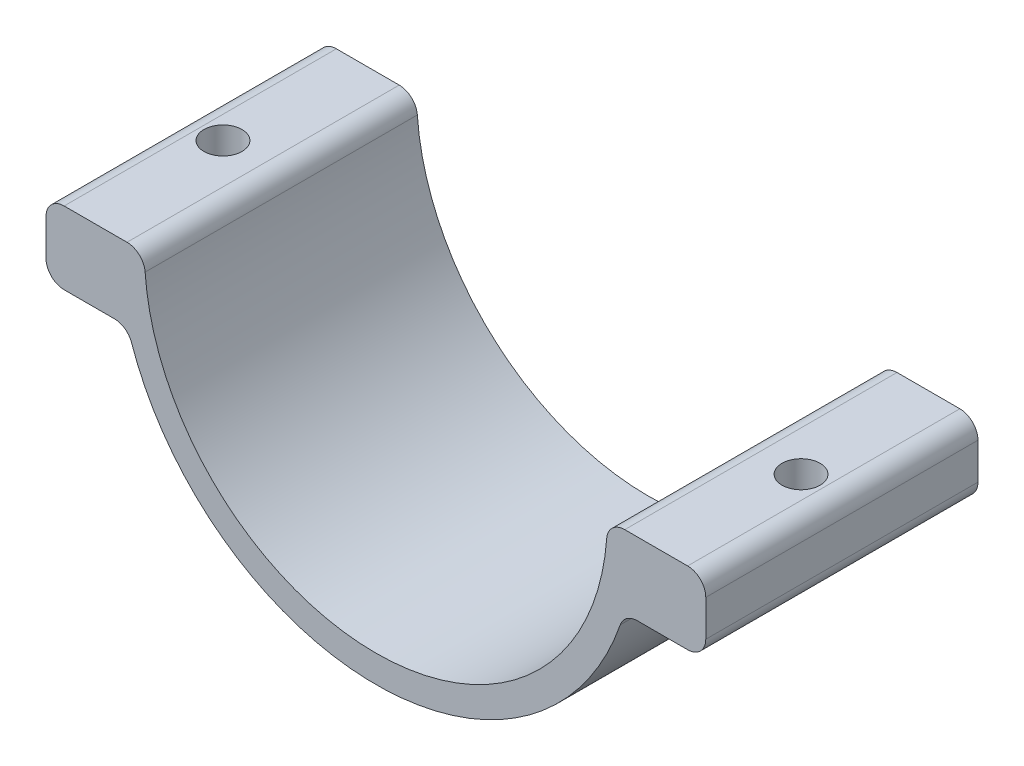
ISO-10303-21;
HEADER;
FILE_DESCRIPTION(('STEP AP214'),'2;1');
FILE_NAME('part.step','',(''),(''),'','','');
FILE_SCHEMA(('AUTOMOTIVE_DESIGN { 1 0 10303 214 1 1 1 1 }'));
ENDSEC;
DATA;
#1=APPLICATION_CONTEXT('core data for automotive mechanical design processes');
#2=APPLICATION_PROTOCOL_DEFINITION('international standard','automotive_design',2000,#1);
#3=PRODUCT_CONTEXT('',#1,'mechanical');
#4=PRODUCT('Part','Part','',(#3));
#5=PRODUCT_RELATED_PRODUCT_CATEGORY('part','',(#4));
#6=PRODUCT_DEFINITION_FORMATION('','',#4);
#7=PRODUCT_DEFINITION_CONTEXT('part definition',#1,'design');
#8=PRODUCT_DEFINITION('design','',#6,#7);
#9=PRODUCT_DEFINITION_SHAPE('','',#8);
#10=(LENGTH_UNIT() NAMED_UNIT(*) SI_UNIT(.MILLI.,.METRE.));
#11=(NAMED_UNIT(*) PLANE_ANGLE_UNIT() SI_UNIT($,.RADIAN.));
#12=(NAMED_UNIT(*) SI_UNIT($,.STERADIAN.) SOLID_ANGLE_UNIT());
#13=UNCERTAINTY_MEASURE_WITH_UNIT(LENGTH_MEASURE(1.E-05),#10,'distance_accuracy_value','');
#14=(GEOMETRIC_REPRESENTATION_CONTEXT(3) GLOBAL_UNCERTAINTY_ASSIGNED_CONTEXT((#13)) GLOBAL_UNIT_ASSIGNED_CONTEXT((#10,
#11,#12)) REPRESENTATION_CONTEXT('',''));
#15=CARTESIAN_POINT('',(0.,0.,0.));
#16=DIRECTION('',(0.,0.,1.));
#17=DIRECTION('',(1.,0.,0.));
#18=AXIS2_PLACEMENT_3D('',#15,#16,#17);
#19=CARTESIAN_POINT('',(-36.3541587331799,-8.,30.));
#20=DIRECTION('',(1.,0.,0.));
#21=DIRECTION('',(0.,0.,-1.));
#22=AXIS2_PLACEMENT_3D('',#19,#20,#21);
#23=PLANE('',#22);
#24=DIRECTION('',(0.,-1.,0.));
#25=VECTOR('',#24,1.);
#26=CARTESIAN_POINT('',(-36.3541587331799,-8.,0.));
#27=LINE('',#26,#25);
#28=CARTESIAN_POINT('',(-36.3541587331799,-2.,0.));
#29=VERTEX_POINT('',#28);
#30=CARTESIAN_POINT('',(-36.3541587331799,-6.,0.));
#31=VERTEX_POINT('',#30);
#32=EDGE_CURVE('E273',#29,#31,#27,.T.);
#33=ORIENTED_EDGE('',*,*,#32,.T.);
#34=DIRECTION('',(0.,0.,-1.));
#35=VECTOR('',#34,1.);
#36=CARTESIAN_POINT('',(-36.3541587331799,-6.,30.));
#37=LINE('',#36,#35);
#38=CARTESIAN_POINT('',(-36.3541587331799,-6.,30.));
#39=VERTEX_POINT('',#38);
#40=EDGE_CURVE('E241',#31,#39,#37,.F.);
#41=ORIENTED_EDGE('',*,*,#40,.T.);
#42=DIRECTION('',(0.,-1.,0.));
#43=VECTOR('',#42,1.);
#44=CARTESIAN_POINT('',(-36.3541587331799,-8.,30.));
#45=LINE('',#44,#43);
#46=CARTESIAN_POINT('',(-36.3541587331799,-2.,30.));
#47=VERTEX_POINT('',#46);
#48=EDGE_CURVE('E194',#47,#39,#45,.T.);
#49=ORIENTED_EDGE('',*,*,#48,.F.);
#50=DIRECTION('',(0.,0.,-1.));
#51=VECTOR('',#50,1.);
#52=CARTESIAN_POINT('',(-36.3541587331799,-2.,30.));
#53=LINE('',#52,#51);
#54=EDGE_CURVE('E238',#47,#29,#53,.T.);
#55=ORIENTED_EDGE('',*,*,#54,.T.);
#56=EDGE_LOOP('',(#33,#41,#49,#55));
#57=FACE_BOUND('',#56,.T.);
#58=ADVANCED_FACE('F40',(#57),#23,.F.);
#59=CARTESIAN_POINT('',(-27.3541587331799,-8.,30.));
#60=DIRECTION('',(0.,1.,0.));
#61=DIRECTION('',(-1.,0.,0.));
#62=AXIS2_PLACEMENT_3D('',#59,#60,#61);
#63=PLANE('',#62);
#64=CARTESIAN_POINT('',(-31.8541587331799,-8.,15.));
#65=DIRECTION('',(0.,1.,0.));
#66=DIRECTION('',(-1.,0.,0.));
#67=AXIS2_PLACEMENT_3D('',#64,#65,#66);
#68=CIRCLE('',#67,1.65);
#69=CARTESIAN_POINT('',(-33.5041587331799,-8.,15.));
#70=VERTEX_POINT('',#69);
#71=EDGE_CURVE('E203',#70,#70,#68,.F.);
#72=ORIENTED_EDGE('',*,*,#71,.F.);
#73=EDGE_LOOP('',(#72));
#74=FACE_BOUND('',#73,.T.);
#75=DIRECTION('',(1.,0.,0.));
#76=VECTOR('',#75,1.);
#77=CARTESIAN_POINT('',(-27.3541587331799,-8.,30.));
#78=LINE('',#77,#76);
#79=CARTESIAN_POINT('',(-34.3541587331798,-8.,30.));
#80=VERTEX_POINT('',#79);
#81=CARTESIAN_POINT('',(-28.8140590684478,-8.,30.));
#82=VERTEX_POINT('',#81);
#83=EDGE_CURVE('E282',#80,#82,#78,.T.);
#84=ORIENTED_EDGE('',*,*,#83,.F.);
#85=DIRECTION('',(0.,0.,-1.));
#86=VECTOR('',#85,1.);
#87=CARTESIAN_POINT('',(-34.3541587331798,-8.,30.));
#88=LINE('',#87,#86);
#89=CARTESIAN_POINT('',(-34.3541587331798,-8.,0.));
#90=VERTEX_POINT('',#89);
#91=EDGE_CURVE('E235',#80,#90,#88,.T.);
#92=ORIENTED_EDGE('',*,*,#91,.T.);
#93=DIRECTION('',(1.,0.,0.));
#94=VECTOR('',#93,1.);
#95=CARTESIAN_POINT('',(-27.3541587331799,-8.,0.));
#96=LINE('',#95,#94);
#97=CARTESIAN_POINT('',(-28.8140590684478,-8.,0.));
#98=VERTEX_POINT('',#97);
#99=EDGE_CURVE('E263',#90,#98,#96,.T.);
#100=ORIENTED_EDGE('',*,*,#99,.T.);
#101=DIRECTION('',(0.,0.,1.));
#102=VECTOR('',#101,1.);
#103=CARTESIAN_POINT('',(-28.8140590684478,-8.,30.));
#104=LINE('',#103,#102);
#105=EDGE_CURVE('E233',#98,#82,#104,.T.);
#106=ORIENTED_EDGE('',*,*,#105,.T.);
#107=EDGE_LOOP('',(#84,#92,#100,#106));
#108=FACE_BOUND('',#107,.T.);
#109=ADVANCED_FACE('F270',(#74,#108),#63,.F.);
#110=CARTESIAN_POINT('',(0.,0.,30.));
#111=DIRECTION('',(0.,0.,-1.));
#112=DIRECTION('',(-1.,0.,0.));
#113=AXIS2_PLACEMENT_3D('',#110,#111,#112);
#114=CYLINDRICAL_SURFACE('',#113,28.5);
#115=CARTESIAN_POINT('',(0.,0.,0.));
#116=DIRECTION('',(0.,0.,1.));
#117=DIRECTION('',(1.,0.,0.));
#118=AXIS2_PLACEMENT_3D('',#115,#116,#117);
#119=CIRCLE('',#118,28.5);
#120=CARTESIAN_POINT('',(-26.9246125721562,-9.34426229508197,0.));
#121=VERTEX_POINT('',#120);
#122=CARTESIAN_POINT('',(26.9246125721562,-9.34426229508197,0.));
#123=VERTEX_POINT('',#122);
#124=EDGE_CURVE('E186',#121,#123,#119,.T.);
#125=ORIENTED_EDGE('',*,*,#124,.T.);
#126=DIRECTION('',(0.,0.,-1.));
#127=VECTOR('',#126,1.);
#128=CARTESIAN_POINT('',(26.9246125721562,-9.34426229508197,30.));
#129=LINE('',#128,#127);
#130=CARTESIAN_POINT('',(26.9246125721562,-9.34426229508197,30.));
#131=VERTEX_POINT('',#130);
#132=EDGE_CURVE('E255',#123,#131,#129,.F.);
#133=ORIENTED_EDGE('',*,*,#132,.T.);
#134=CARTESIAN_POINT('',(0.,0.,30.));
#135=DIRECTION('',(0.,0.,1.));
#136=DIRECTION('',(1.,0.,0.));
#137=AXIS2_PLACEMENT_3D('',#134,#135,#136);
#138=CIRCLE('',#137,28.5);
#139=CARTESIAN_POINT('',(-26.9246125721562,-9.34426229508197,30.));
#140=VERTEX_POINT('',#139);
#141=EDGE_CURVE('E280',#140,#131,#138,.T.);
#142=ORIENTED_EDGE('',*,*,#141,.F.);
#143=DIRECTION('',(0.,0.,-1.));
#144=VECTOR('',#143,1.);
#145=CARTESIAN_POINT('',(-26.9246125721562,-9.34426229508197,30.));
#146=LINE('',#145,#144);
#147=EDGE_CURVE('E252',#140,#121,#146,.T.);
#148=ORIENTED_EDGE('',*,*,#147,.T.);
#149=EDGE_LOOP('',(#125,#133,#142,#148));
#150=FACE_BOUND('',#149,.T.);
#151=ADVANCED_FACE('F284',(#150),#114,.T.);
#152=CARTESIAN_POINT('',(27.3541587331799,-8.,30.));
#153=DIRECTION('',(0.,1.,0.));
#154=DIRECTION('',(-1.,0.,0.));
#155=AXIS2_PLACEMENT_3D('',#152,#153,#154);
#156=PLANE('',#155);
#157=CARTESIAN_POINT('',(31.8541587331799,-8.,15.));
#158=DIRECTION('',(0.,1.,0.));
#159=DIRECTION('',(-1.,0.,0.));
#160=AXIS2_PLACEMENT_3D('',#157,#158,#159);
#161=CIRCLE('',#160,1.65);
#162=CARTESIAN_POINT('',(30.2041587331799,-8.,15.));
#163=VERTEX_POINT('',#162);
#164=EDGE_CURVE('E198',#163,#163,#161,.T.);
#165=ORIENTED_EDGE('',*,*,#164,.T.);
#166=EDGE_LOOP('',(#165));
#167=FACE_BOUND('',#166,.T.);
#168=DIRECTION('',(1.,0.,0.));
#169=VECTOR('',#168,1.);
#170=CARTESIAN_POINT('',(27.3541587331799,-8.,0.));
#171=LINE('',#170,#169);
#172=CARTESIAN_POINT('',(28.8140590684478,-8.,0.));
#173=VERTEX_POINT('',#172);
#174=CARTESIAN_POINT('',(34.3541587331798,-8.,0.));
#175=VERTEX_POINT('',#174);
#176=EDGE_CURVE('E181',#173,#175,#171,.T.);
#177=ORIENTED_EDGE('',*,*,#176,.T.);
#178=DIRECTION('',(0.,0.,-1.));
#179=VECTOR('',#178,1.);
#180=CARTESIAN_POINT('',(34.3541587331798,-8.,30.));
#181=LINE('',#180,#179);
#182=CARTESIAN_POINT('',(34.3541587331798,-8.,30.));
#183=VERTEX_POINT('',#182);
#184=EDGE_CURVE('E159',#175,#183,#181,.F.);
#185=ORIENTED_EDGE('',*,*,#184,.T.);
#186=DIRECTION('',(1.,0.,0.));
#187=VECTOR('',#186,1.);
#188=CARTESIAN_POINT('',(27.3541587331799,-8.,30.));
#189=LINE('',#188,#187);
#190=CARTESIAN_POINT('',(28.8140590684478,-8.,30.));
#191=VERTEX_POINT('',#190);
#192=EDGE_CURVE('E286',#191,#183,#189,.T.);
#193=ORIENTED_EDGE('',*,*,#192,.F.);
#194=DIRECTION('',(0.,0.,1.));
#195=VECTOR('',#194,1.);
#196=CARTESIAN_POINT('',(28.8140590684478,-8.,0.));
#197=LINE('',#196,#195);
#198=EDGE_CURVE('E164',#191,#173,#197,.F.);
#199=ORIENTED_EDGE('',*,*,#198,.T.);
#200=EDGE_LOOP('',(#177,#185,#193,#199));
#201=FACE_BOUND('',#200,.T.);
#202=ADVANCED_FACE('F306',(#167,#201),#156,.F.);
#203=CARTESIAN_POINT('',(36.3541587331799,-8.,30.));
#204=DIRECTION('',(-1.,0.,0.));
#205=DIRECTION('',(0.,0.,1.));
#206=AXIS2_PLACEMENT_3D('',#203,#204,#205);
#207=PLANE('',#206);
#208=DIRECTION('',(0.,1.,0.));
#209=VECTOR('',#208,1.);
#210=CARTESIAN_POINT('',(36.3541587331799,-8.,30.));
#211=LINE('',#210,#209);
#212=CARTESIAN_POINT('',(36.3541587331799,-6.,30.));
#213=VERTEX_POINT('',#212);
#214=CARTESIAN_POINT('',(36.3541587331799,-2.,30.));
#215=VERTEX_POINT('',#214);
#216=EDGE_CURVE('E174',#213,#215,#211,.T.);
#217=ORIENTED_EDGE('',*,*,#216,.F.);
#218=DIRECTION('',(0.,0.,-1.));
#219=VECTOR('',#218,1.);
#220=CARTESIAN_POINT('',(36.3541587331799,-6.,30.));
#221=LINE('',#220,#219);
#222=CARTESIAN_POINT('',(36.3541587331799,-6.,0.));
#223=VERTEX_POINT('',#222);
#224=EDGE_CURVE('E158',#213,#223,#221,.T.);
#225=ORIENTED_EDGE('',*,*,#224,.T.);
#226=DIRECTION('',(0.,1.,0.));
#227=VECTOR('',#226,1.);
#228=CARTESIAN_POINT('',(36.3541587331799,-8.,0.));
#229=LINE('',#228,#227);
#230=CARTESIAN_POINT('',(36.3541587331799,-2.,0.));
#231=VERTEX_POINT('',#230);
#232=EDGE_CURVE('E171',#223,#231,#229,.T.);
#233=ORIENTED_EDGE('',*,*,#232,.T.);
#234=DIRECTION('',(0.,0.,-1.));
#235=VECTOR('',#234,1.);
#236=CARTESIAN_POINT('',(36.3541587331799,-2.,30.));
#237=LINE('',#236,#235);
#238=EDGE_CURVE('E176',#231,#215,#237,.F.);
#239=ORIENTED_EDGE('',*,*,#238,.T.);
#240=EDGE_LOOP('',(#217,#225,#233,#239));
#241=FACE_BOUND('',#240,.T.);
#242=ADVANCED_FACE('F170',(#241),#207,.F.);
#243=CARTESIAN_POINT('',(25.5,0.,30.));
#244=DIRECTION('',(0.,-1.,0.));
#245=DIRECTION('',(1.,0.,0.));
#246=AXIS2_PLACEMENT_3D('',#243,#244,#245);
#247=PLANE('',#246);
#248=CARTESIAN_POINT('',(31.8541587331799,0.,15.));
#249=DIRECTION('',(0.,-1.,0.));
#250=DIRECTION('',(1.,0.,0.));
#251=AXIS2_PLACEMENT_3D('',#248,#249,#250);
#252=CIRCLE('',#251,2.09999999999999);
#253=CARTESIAN_POINT('',(33.9541587331799,0.,15.));
#254=VERTEX_POINT('',#253);
#255=EDGE_CURVE('E582',#254,#254,#252,.T.);
#256=ORIENTED_EDGE('',*,*,#255,.T.);
#257=EDGE_LOOP('',(#256));
#258=FACE_BOUND('',#257,.T.);
#259=DIRECTION('',(-1.,0.,0.));
#260=VECTOR('',#259,1.);
#261=CARTESIAN_POINT('',(25.5,0.,30.));
#262=LINE('',#261,#260);
#263=CARTESIAN_POINT('',(34.3541587331798,0.,30.));
#264=VERTEX_POINT('',#263);
#265=CARTESIAN_POINT('',(27.427176303805,0.,30.));
#266=VERTEX_POINT('',#265);
#267=EDGE_CURVE('E293',#264,#266,#262,.T.);
#268=ORIENTED_EDGE('',*,*,#267,.F.);
#269=DIRECTION('',(0.,0.,-1.));
#270=VECTOR('',#269,1.);
#271=CARTESIAN_POINT('',(34.3541587331798,0.,30.));
#272=LINE('',#271,#270);
#273=CARTESIAN_POINT('',(34.3541587331798,0.,0.));
#274=VERTEX_POINT('',#273);
#275=EDGE_CURVE('E230',#264,#274,#272,.T.);
#276=ORIENTED_EDGE('',*,*,#275,.T.);
#277=DIRECTION('',(-1.,0.,0.));
#278=VECTOR('',#277,1.);
#279=CARTESIAN_POINT('',(25.5,0.,0.));
#280=LINE('',#279,#278);
#281=CARTESIAN_POINT('',(27.427176303805,0.,0.));
#282=VERTEX_POINT('',#281);
#283=EDGE_CURVE('E180',#274,#282,#280,.T.);
#284=ORIENTED_EDGE('',*,*,#283,.T.);
#285=DIRECTION('',(0.,0.,-1.));
#286=VECTOR('',#285,1.);
#287=CARTESIAN_POINT('',(27.427176303805,0.,30.));
#288=LINE('',#287,#286);
#289=EDGE_CURVE('E228',#282,#266,#288,.F.);
#290=ORIENTED_EDGE('',*,*,#289,.T.);
#291=EDGE_LOOP('',(#268,#276,#284,#290));
#292=FACE_BOUND('',#291,.T.);
#293=ADVANCED_FACE('F314',(#258,#292),#247,.F.);
#294=CARTESIAN_POINT('',(0.,0.,30.));
#295=DIRECTION('',(0.,0.,-1.));
#296=DIRECTION('',(-1.,0.,0.));
#297=AXIS2_PLACEMENT_3D('',#294,#295,#296);
#298=CYLINDRICAL_SURFACE('',#297,25.5);
#299=CARTESIAN_POINT('',(0.,0.,0.));
#300=DIRECTION('',(0.,0.,-1.));
#301=DIRECTION('',(-1.,0.,0.));
#302=AXIS2_PLACEMENT_3D('',#299,#300,#301);
#303=CIRCLE('',#302,25.5);
#304=CARTESIAN_POINT('',(25.4324725726191,-1.85454545454545,0.));
#305=VERTEX_POINT('',#304);
#306=CARTESIAN_POINT('',(-25.4324725726191,-1.85454545454545,0.));
#307=VERTEX_POINT('',#306);
#308=EDGE_CURVE('E184',#305,#307,#303,.T.);
#309=ORIENTED_EDGE('',*,*,#308,.T.);
#310=DIRECTION('',(0.,0.,-1.));
#311=VECTOR('',#310,1.);
#312=CARTESIAN_POINT('',(-25.4324725726191,-1.85454545454545,30.));
#313=LINE('',#312,#311);
#314=CARTESIAN_POINT('',(-25.4324725726191,-1.85454545454545,30.));
#315=VERTEX_POINT('',#314);
#316=EDGE_CURVE('E250',#307,#315,#313,.F.);
#317=ORIENTED_EDGE('',*,*,#316,.T.);
#318=CARTESIAN_POINT('',(0.,0.,30.));
#319=DIRECTION('',(0.,0.,-1.));
#320=DIRECTION('',(-1.,0.,0.));
#321=AXIS2_PLACEMENT_3D('',#318,#319,#320);
#322=CIRCLE('',#321,25.5);
#323=CARTESIAN_POINT('',(25.4324725726191,-1.85454545454545,30.));
#324=VERTEX_POINT('',#323);
#325=EDGE_CURVE('E296',#324,#315,#322,.T.);
#326=ORIENTED_EDGE('',*,*,#325,.F.);
#327=DIRECTION('',(0.,0.,-1.));
#328=VECTOR('',#327,1.);
#329=CARTESIAN_POINT('',(25.4324725726191,-1.85454545454545,30.));
#330=LINE('',#329,#328);
#331=EDGE_CURVE('E247',#324,#305,#330,.T.);
#332=ORIENTED_EDGE('',*,*,#331,.T.);
#333=EDGE_LOOP('',(#309,#317,#326,#332));
#334=FACE_BOUND('',#333,.T.);
#335=ADVANCED_FACE('F436',(#334),#298,.F.);
#336=CARTESIAN_POINT('',(-25.5,0.,30.));
#337=DIRECTION('',(0.,-1.,0.));
#338=DIRECTION('',(1.,0.,0.));
#339=AXIS2_PLACEMENT_3D('',#336,#337,#338);
#340=PLANE('',#339);
#341=CARTESIAN_POINT('',(-31.8541587331799,0.,15.));
#342=DIRECTION('',(0.,1.,0.));
#343=DIRECTION('',(-1.,0.,0.));
#344=AXIS2_PLACEMENT_3D('',#341,#342,#343);
#345=CIRCLE('',#344,2.09999999999999);
#346=CARTESIAN_POINT('',(-33.9541587331799,0.,15.));
#347=VERTEX_POINT('',#346);
#348=EDGE_CURVE('E606',#347,#347,#345,.T.);
#349=ORIENTED_EDGE('',*,*,#348,.F.);
#350=EDGE_LOOP('',(#349));
#351=FACE_BOUND('',#350,.T.);
#352=DIRECTION('',(-1.,0.,0.));
#353=VECTOR('',#352,1.);
#354=CARTESIAN_POINT('',(-25.5,0.,0.));
#355=LINE('',#354,#353);
#356=CARTESIAN_POINT('',(-27.427176303805,0.,0.));
#357=VERTEX_POINT('',#356);
#358=CARTESIAN_POINT('',(-34.3541587331798,0.,0.));
#359=VERTEX_POINT('',#358);
#360=EDGE_CURVE('E192',#357,#359,#355,.T.);
#361=ORIENTED_EDGE('',*,*,#360,.T.);
#362=DIRECTION('',(0.,0.,-1.));
#363=VECTOR('',#362,1.);
#364=CARTESIAN_POINT('',(-34.3541587331798,0.,30.));
#365=LINE('',#364,#363);
#366=CARTESIAN_POINT('',(-34.3541587331798,0.,30.));
#367=VERTEX_POINT('',#366);
#368=EDGE_CURVE('E55',#359,#367,#365,.F.);
#369=ORIENTED_EDGE('',*,*,#368,.T.);
#370=DIRECTION('',(-1.,0.,0.));
#371=VECTOR('',#370,1.);
#372=CARTESIAN_POINT('',(-25.5,0.,30.));
#373=LINE('',#372,#371);
#374=CARTESIAN_POINT('',(-27.427176303805,0.,30.));
#375=VERTEX_POINT('',#374);
#376=EDGE_CURVE('E204',#375,#367,#373,.T.);
#377=ORIENTED_EDGE('',*,*,#376,.F.);
#378=DIRECTION('',(0.,0.,-1.));
#379=VECTOR('',#378,1.);
#380=CARTESIAN_POINT('',(-27.427176303805,0.,30.));
#381=LINE('',#380,#379);
#382=EDGE_CURVE('E243',#375,#357,#381,.T.);
#383=ORIENTED_EDGE('',*,*,#382,.T.);
#384=EDGE_LOOP('',(#361,#369,#377,#383));
#385=FACE_BOUND('',#384,.T.);
#386=ADVANCED_FACE('F426',(#351,#385),#340,.F.);
#387=CARTESIAN_POINT('',(0.,0.,30.));
#388=DIRECTION('',(0.,0.,-1.));
#389=DIRECTION('',(-1.,0.,0.));
#390=AXIS2_PLACEMENT_3D('',#387,#388,#389);
#391=PLANE('',#390);
#392=ORIENTED_EDGE('',*,*,#192,.T.);
#393=CARTESIAN_POINT('',(34.3541587331798,-6.,30.));
#394=DIRECTION('',(0.,0.,-1.));
#395=DIRECTION('',(-1.,0.,0.));
#396=AXIS2_PLACEMENT_3D('',#393,#394,#395);
#397=CIRCLE('',#396,2.);
#398=EDGE_CURVE('E226',#183,#213,#397,.F.);
#399=ORIENTED_EDGE('',*,*,#398,.T.);
#400=ORIENTED_EDGE('',*,*,#216,.T.);
#401=CARTESIAN_POINT('',(34.3541587331798,-2.,30.));
#402=DIRECTION('',(0.,0.,-1.));
#403=DIRECTION('',(-1.,0.,0.));
#404=AXIS2_PLACEMENT_3D('',#401,#402,#403);
#405=CIRCLE('',#404,2.);
#406=EDGE_CURVE('E224',#215,#264,#405,.F.);
#407=ORIENTED_EDGE('',*,*,#406,.T.);
#408=ORIENTED_EDGE('',*,*,#267,.T.);
#409=CARTESIAN_POINT('',(27.427176303805,-2.,30.));
#410=DIRECTION('',(0.,0.,-1.));
#411=DIRECTION('',(-1.,0.,0.));
#412=AXIS2_PLACEMENT_3D('',#409,#410,#411);
#413=CIRCLE('',#412,2.);
#414=EDGE_CURVE('E217',#266,#324,#413,.F.);
#415=ORIENTED_EDGE('',*,*,#414,.T.);
#416=ORIENTED_EDGE('',*,*,#325,.T.);
#417=CARTESIAN_POINT('',(-27.427176303805,-2.,30.));
#418=DIRECTION('',(0.,0.,-1.));
#419=DIRECTION('',(-1.,0.,0.));
#420=AXIS2_PLACEMENT_3D('',#417,#418,#419);
#421=CIRCLE('',#420,2.);
#422=EDGE_CURVE('E62',#315,#375,#421,.F.);
#423=ORIENTED_EDGE('',*,*,#422,.T.);
#424=ORIENTED_EDGE('',*,*,#376,.T.);
#425=CARTESIAN_POINT('',(-34.3541587331798,-2.,30.));
#426=DIRECTION('',(0.,0.,-1.));
#427=DIRECTION('',(-1.,0.,0.));
#428=AXIS2_PLACEMENT_3D('',#425,#426,#427);
#429=CIRCLE('',#428,2.);
#430=EDGE_CURVE('E220',#367,#47,#429,.F.);
#431=ORIENTED_EDGE('',*,*,#430,.T.);
#432=ORIENTED_EDGE('',*,*,#48,.T.);
#433=CARTESIAN_POINT('',(-34.3541587331798,-6.,30.));
#434=DIRECTION('',(0.,0.,-1.));
#435=DIRECTION('',(-1.,0.,0.));
#436=AXIS2_PLACEMENT_3D('',#433,#434,#435);
#437=CIRCLE('',#436,2.);
#438=EDGE_CURVE('E222',#39,#80,#437,.F.);
#439=ORIENTED_EDGE('',*,*,#438,.T.);
#440=ORIENTED_EDGE('',*,*,#83,.T.);
#441=CARTESIAN_POINT('',(-28.8140590684478,-10.,30.));
#442=DIRECTION('',(0.,0.,-1.));
#443=DIRECTION('',(-1.,0.,0.));
#444=AXIS2_PLACEMENT_3D('',#441,#442,#443);
#445=CIRCLE('',#444,2.);
#446=EDGE_CURVE('E11',#82,#140,#445,.T.);
#447=ORIENTED_EDGE('',*,*,#446,.T.);
#448=ORIENTED_EDGE('',*,*,#141,.T.);
#449=CARTESIAN_POINT('',(28.8140590684478,-10.,30.));
#450=DIRECTION('',(0.,0.,-1.));
#451=DIRECTION('',(-1.,0.,0.));
#452=AXIS2_PLACEMENT_3D('',#449,#450,#451);
#453=CIRCLE('',#452,2.);
#454=EDGE_CURVE('E259',#131,#191,#453,.T.);
#455=ORIENTED_EDGE('',*,*,#454,.T.);
#456=EDGE_LOOP('',(#392,#399,#400,#407,#408,#415,#416,#423,#424,#431,#432,#439,#440,#447,#448,#455));
#457=FACE_BOUND('',#456,.T.);
#458=ADVANCED_FACE('F279',(#457),#391,.F.);
#459=CARTESIAN_POINT('',(0.,0.,0.));
#460=DIRECTION('',(0.,0.,-1.));
#461=DIRECTION('',(-1.,0.,0.));
#462=AXIS2_PLACEMENT_3D('',#459,#460,#461);
#463=PLANE('',#462);
#464=ORIENTED_EDGE('',*,*,#232,.F.);
#465=CARTESIAN_POINT('',(34.3541587331798,-6.,0.));
#466=DIRECTION('',(0.,0.,-1.));
#467=DIRECTION('',(-1.,0.,0.));
#468=AXIS2_PLACEMENT_3D('',#465,#466,#467);
#469=CIRCLE('',#468,2.);
#470=EDGE_CURVE('E154',#223,#175,#469,.T.);
#471=ORIENTED_EDGE('',*,*,#470,.T.);
#472=ORIENTED_EDGE('',*,*,#176,.F.);
#473=CARTESIAN_POINT('',(28.8140590684478,-10.,0.));
#474=DIRECTION('',(0.,0.,-1.));
#475=DIRECTION('',(-1.,0.,0.));
#476=AXIS2_PLACEMENT_3D('',#473,#474,#475);
#477=CIRCLE('',#476,2.);
#478=EDGE_CURVE('E257',#173,#123,#477,.F.);
#479=ORIENTED_EDGE('',*,*,#478,.T.);
#480=ORIENTED_EDGE('',*,*,#124,.F.);
#481=CARTESIAN_POINT('',(-28.8140590684478,-10.,0.));
#482=DIRECTION('',(0.,0.,-1.));
#483=DIRECTION('',(-1.,0.,0.));
#484=AXIS2_PLACEMENT_3D('',#481,#482,#483);
#485=CIRCLE('',#484,2.);
#486=EDGE_CURVE('E48',#121,#98,#485,.F.);
#487=ORIENTED_EDGE('',*,*,#486,.T.);
#488=ORIENTED_EDGE('',*,*,#99,.F.);
#489=CARTESIAN_POINT('',(-34.3541587331798,-6.,0.));
#490=DIRECTION('',(0.,0.,-1.));
#491=DIRECTION('',(-1.,0.,0.));
#492=AXIS2_PLACEMENT_3D('',#489,#490,#491);
#493=CIRCLE('',#492,2.);
#494=EDGE_CURVE('E211',#90,#31,#493,.T.);
#495=ORIENTED_EDGE('',*,*,#494,.T.);
#496=ORIENTED_EDGE('',*,*,#32,.F.);
#497=CARTESIAN_POINT('',(-34.3541587331798,-2.,0.));
#498=DIRECTION('',(0.,0.,-1.));
#499=DIRECTION('',(-1.,0.,0.));
#500=AXIS2_PLACEMENT_3D('',#497,#498,#499);
#501=CIRCLE('',#500,2.);
#502=EDGE_CURVE('E209',#29,#359,#501,.T.);
#503=ORIENTED_EDGE('',*,*,#502,.T.);
#504=ORIENTED_EDGE('',*,*,#360,.F.);
#505=CARTESIAN_POINT('',(-27.427176303805,-2.,0.));
#506=DIRECTION('',(0.,0.,-1.));
#507=DIRECTION('',(-1.,0.,0.));
#508=AXIS2_PLACEMENT_3D('',#505,#506,#507);
#509=CIRCLE('',#508,2.);
#510=EDGE_CURVE('E207',#357,#307,#509,.T.);
#511=ORIENTED_EDGE('',*,*,#510,.T.);
#512=ORIENTED_EDGE('',*,*,#308,.F.);
#513=CARTESIAN_POINT('',(27.427176303805,-2.,0.));
#514=DIRECTION('',(0.,0.,-1.));
#515=DIRECTION('',(-1.,0.,0.));
#516=AXIS2_PLACEMENT_3D('',#513,#514,#515);
#517=CIRCLE('',#516,2.);
#518=EDGE_CURVE('E175',#305,#282,#517,.T.);
#519=ORIENTED_EDGE('',*,*,#518,.T.);
#520=ORIENTED_EDGE('',*,*,#283,.F.);
#521=CARTESIAN_POINT('',(34.3541587331798,-2.,0.));
#522=DIRECTION('',(0.,0.,-1.));
#523=DIRECTION('',(-1.,0.,0.));
#524=AXIS2_PLACEMENT_3D('',#521,#522,#523);
#525=CIRCLE('',#524,2.);
#526=EDGE_CURVE('E165',#274,#231,#525,.T.);
#527=ORIENTED_EDGE('',*,*,#526,.T.);
#528=EDGE_LOOP('',(#464,#471,#472,#479,#480,#487,#488,#495,#496,#503,#504,#511,#512,#519,#520,#527));
#529=FACE_BOUND('',#528,.T.);
#530=ADVANCED_FACE('F178',(#529),#463,.T.);
#531=CARTESIAN_POINT('',(31.8541587331799,-5.,15.));
#532=DIRECTION('',(0.,1.,0.));
#533=DIRECTION('',(-1.,0.,0.));
#534=AXIS2_PLACEMENT_3D('',#531,#532,#533);
#535=CYLINDRICAL_SURFACE('',#534,2.09999999999999);
#536=CARTESIAN_POINT('',(31.8541587331799,-5.,15.));
#537=DIRECTION('',(0.,-1.,0.));
#538=DIRECTION('',(1.,0.,0.));
#539=AXIS2_PLACEMENT_3D('',#536,#537,#538);
#540=CIRCLE('',#539,2.09999999999999);
#541=CARTESIAN_POINT('',(33.9541587331799,-5.,15.));
#542=VERTEX_POINT('',#541);
#543=EDGE_CURVE('E300',#542,#542,#540,.T.);
#544=ORIENTED_EDGE('',*,*,#543,.T.);
#545=EDGE_LOOP('',(#544));
#546=FACE_BOUND('',#545,.T.);
#547=ORIENTED_EDGE('',*,*,#255,.F.);
#548=EDGE_LOOP('',(#547));
#549=FACE_BOUND('',#548,.T.);
#550=ADVANCED_FACE('F414',(#546,#549),#535,.F.);
#551=CARTESIAN_POINT('',(31.8541587331799,-5.,15.));
#552=DIRECTION('',(0.,-1.,0.));
#553=DIRECTION('',(1.,0.,0.));
#554=AXIS2_PLACEMENT_3D('',#551,#552,#553);
#555=PLANE('',#554);
#556=CARTESIAN_POINT('',(31.8541587331799,-5.,15.));
#557=DIRECTION('',(0.,-1.,0.));
#558=DIRECTION('',(1.,0.,0.));
#559=AXIS2_PLACEMENT_3D('',#556,#557,#558);
#560=CIRCLE('',#559,1.65);
#561=CARTESIAN_POINT('',(33.5041587331799,-5.,15.));
#562=VERTEX_POINT('',#561);
#563=EDGE_CURVE('E195',#562,#562,#560,.T.);
#564=ORIENTED_EDGE('',*,*,#563,.T.);
#565=EDGE_LOOP('',(#564));
#566=FACE_BOUND('',#565,.T.);
#567=ORIENTED_EDGE('',*,*,#543,.F.);
#568=EDGE_LOOP('',(#567));
#569=FACE_BOUND('',#568,.T.);
#570=ADVANCED_FACE('F529',(#566,#569),#555,.F.);
#571=CARTESIAN_POINT('',(31.8541587331799,-28.5,15.));
#572=DIRECTION('',(0.,1.,0.));
#573=DIRECTION('',(-1.,0.,0.));
#574=AXIS2_PLACEMENT_3D('',#571,#572,#573);
#575=CYLINDRICAL_SURFACE('',#574,1.65);
#576=ORIENTED_EDGE('',*,*,#563,.F.);
#577=EDGE_LOOP('',(#576));
#578=FACE_BOUND('',#577,.T.);
#579=ORIENTED_EDGE('',*,*,#164,.F.);
#580=EDGE_LOOP('',(#579));
#581=FACE_BOUND('',#580,.T.);
#582=ADVANCED_FACE('F518',(#578,#581),#575,.F.);
#583=CARTESIAN_POINT('',(-31.8541587331799,-5.,15.));
#584=DIRECTION('',(0.,1.,0.));
#585=DIRECTION('',(-1.,0.,0.));
#586=AXIS2_PLACEMENT_3D('',#583,#584,#585);
#587=CYLINDRICAL_SURFACE('',#586,2.09999999999999);
#588=CARTESIAN_POINT('',(-31.8541587331799,-5.,15.));
#589=DIRECTION('',(0.,1.,0.));
#590=DIRECTION('',(-1.,0.,0.));
#591=AXIS2_PLACEMENT_3D('',#588,#589,#590);
#592=CIRCLE('',#591,2.09999999999999);
#593=CARTESIAN_POINT('',(-33.9541587331799,-5.,15.));
#594=VERTEX_POINT('',#593);
#595=EDGE_CURVE('E199',#594,#594,#592,.T.);
#596=ORIENTED_EDGE('',*,*,#595,.F.);
#597=EDGE_LOOP('',(#596));
#598=FACE_BOUND('',#597,.T.);
#599=ORIENTED_EDGE('',*,*,#348,.T.);
#600=EDGE_LOOP('',(#599));
#601=FACE_BOUND('',#600,.T.);
#602=ADVANCED_FACE('F507',(#598,#601),#587,.F.);
#603=CARTESIAN_POINT('',(-31.8541587331799,-5.,15.));
#604=DIRECTION('',(0.,-1.,0.));
#605=DIRECTION('',(-1.,0.,0.));
#606=AXIS2_PLACEMENT_3D('',#603,#604,#605);
#607=PLANE('',#606);
#608=CARTESIAN_POINT('',(-31.8541587331799,-5.,15.));
#609=DIRECTION('',(0.,-1.,0.));
#610=DIRECTION('',(1.,0.,0.));
#611=AXIS2_PLACEMENT_3D('',#608,#609,#610);
#612=CIRCLE('',#611,1.65);
#613=CARTESIAN_POINT('',(-30.2041587331799,-5.,15.));
#614=VERTEX_POINT('',#613);
#615=EDGE_CURVE('E200',#614,#614,#612,.F.);
#616=ORIENTED_EDGE('',*,*,#615,.F.);
#617=EDGE_LOOP('',(#616));
#618=FACE_BOUND('',#617,.T.);
#619=ORIENTED_EDGE('',*,*,#595,.T.);
#620=EDGE_LOOP('',(#619));
#621=FACE_BOUND('',#620,.T.);
#622=ADVANCED_FACE('F496',(#618,#621),#607,.F.);
#623=CARTESIAN_POINT('',(-31.8541587331799,-28.5,15.));
#624=DIRECTION('',(0.,1.,0.));
#625=DIRECTION('',(-1.,0.,0.));
#626=AXIS2_PLACEMENT_3D('',#623,#624,#625);
#627=CYLINDRICAL_SURFACE('',#626,1.65);
#628=ORIENTED_EDGE('',*,*,#615,.T.);
#629=EDGE_LOOP('',(#628));
#630=FACE_BOUND('',#629,.T.);
#631=ORIENTED_EDGE('',*,*,#71,.T.);
#632=EDGE_LOOP('',(#631));
#633=FACE_BOUND('',#632,.T.);
#634=ADVANCED_FACE('F330',(#630,#633),#627,.F.);
#635=CARTESIAN_POINT('',(34.3541587331798,-6.,30.));
#636=DIRECTION('',(0.,0.,-1.));
#637=DIRECTION('',(-1.,0.,0.));
#638=AXIS2_PLACEMENT_3D('',#635,#636,#637);
#639=CYLINDRICAL_SURFACE('',#638,2.);
#640=ORIENTED_EDGE('',*,*,#398,.F.);
#641=ORIENTED_EDGE('',*,*,#184,.F.);
#642=ORIENTED_EDGE('',*,*,#470,.F.);
#643=ORIENTED_EDGE('',*,*,#224,.F.);
#644=EDGE_LOOP('',(#640,#641,#642,#643));
#645=FACE_BOUND('',#644,.T.);
#646=ADVANCED_FACE('F157',(#645),#639,.T.);
#647=CARTESIAN_POINT('',(34.3541587331798,-2.,30.));
#648=DIRECTION('',(0.,0.,-1.));
#649=DIRECTION('',(-1.,0.,0.));
#650=AXIS2_PLACEMENT_3D('',#647,#648,#649);
#651=CYLINDRICAL_SURFACE('',#650,2.);
#652=ORIENTED_EDGE('',*,*,#406,.F.);
#653=ORIENTED_EDGE('',*,*,#238,.F.);
#654=ORIENTED_EDGE('',*,*,#526,.F.);
#655=ORIENTED_EDGE('',*,*,#275,.F.);
#656=EDGE_LOOP('',(#652,#653,#654,#655));
#657=FACE_BOUND('',#656,.T.);
#658=ADVANCED_FACE('F329',(#657),#651,.T.);
#659=CARTESIAN_POINT('',(-34.3541587331798,-6.,30.));
#660=DIRECTION('',(0.,0.,-1.));
#661=DIRECTION('',(-1.,0.,0.));
#662=AXIS2_PLACEMENT_3D('',#659,#660,#661);
#663=CYLINDRICAL_SURFACE('',#662,2.);
#664=ORIENTED_EDGE('',*,*,#438,.F.);
#665=ORIENTED_EDGE('',*,*,#40,.F.);
#666=ORIENTED_EDGE('',*,*,#494,.F.);
#667=ORIENTED_EDGE('',*,*,#91,.F.);
#668=EDGE_LOOP('',(#664,#665,#666,#667));
#669=FACE_BOUND('',#668,.T.);
#670=ADVANCED_FACE('F333',(#669),#663,.T.);
#671=CARTESIAN_POINT('',(-34.3541587331798,-2.,30.));
#672=DIRECTION('',(0.,0.,-1.));
#673=DIRECTION('',(-1.,0.,0.));
#674=AXIS2_PLACEMENT_3D('',#671,#672,#673);
#675=CYLINDRICAL_SURFACE('',#674,2.);
#676=ORIENTED_EDGE('',*,*,#430,.F.);
#677=ORIENTED_EDGE('',*,*,#368,.F.);
#678=ORIENTED_EDGE('',*,*,#502,.F.);
#679=ORIENTED_EDGE('',*,*,#54,.F.);
#680=EDGE_LOOP('',(#676,#677,#678,#679));
#681=FACE_BOUND('',#680,.T.);
#682=ADVANCED_FACE('F337',(#681),#675,.T.);
#683=CARTESIAN_POINT('',(-27.427176303805,-2.,30.));
#684=DIRECTION('',(0.,0.,-1.));
#685=DIRECTION('',(-1.,0.,0.));
#686=AXIS2_PLACEMENT_3D('',#683,#684,#685);
#687=CYLINDRICAL_SURFACE('',#686,2.);
#688=ORIENTED_EDGE('',*,*,#422,.F.);
#689=ORIENTED_EDGE('',*,*,#316,.F.);
#690=ORIENTED_EDGE('',*,*,#510,.F.);
#691=ORIENTED_EDGE('',*,*,#382,.F.);
#692=EDGE_LOOP('',(#688,#689,#690,#691));
#693=FACE_BOUND('',#692,.T.);
#694=ADVANCED_FACE('F341',(#693),#687,.T.);
#695=CARTESIAN_POINT('',(27.427176303805,-2.,30.));
#696=DIRECTION('',(0.,0.,-1.));
#697=DIRECTION('',(-1.,0.,0.));
#698=AXIS2_PLACEMENT_3D('',#695,#696,#697);
#699=CYLINDRICAL_SURFACE('',#698,2.);
#700=ORIENTED_EDGE('',*,*,#414,.F.);
#701=ORIENTED_EDGE('',*,*,#289,.F.);
#702=ORIENTED_EDGE('',*,*,#518,.F.);
#703=ORIENTED_EDGE('',*,*,#331,.F.);
#704=EDGE_LOOP('',(#700,#701,#702,#703));
#705=FACE_BOUND('',#704,.T.);
#706=ADVANCED_FACE('F345',(#705),#699,.T.);
#707=CARTESIAN_POINT('',(28.8140590684478,-10.,30.));
#708=DIRECTION('',(0.,0.,-1.));
#709=DIRECTION('',(-1.,0.,0.));
#710=AXIS2_PLACEMENT_3D('',#707,#708,#709);
#711=CYLINDRICAL_SURFACE('',#710,2.);
#712=ORIENTED_EDGE('',*,*,#454,.F.);
#713=ORIENTED_EDGE('',*,*,#132,.F.);
#714=ORIENTED_EDGE('',*,*,#478,.F.);
#715=ORIENTED_EDGE('',*,*,#198,.F.);
#716=EDGE_LOOP('',(#712,#713,#714,#715));
#717=FACE_BOUND('',#716,.T.);
#718=ADVANCED_FACE('F302',(#717),#711,.F.);
#719=CARTESIAN_POINT('',(-28.8140590684478,-10.,30.));
#720=DIRECTION('',(0.,0.,-1.));
#721=DIRECTION('',(-1.,0.,0.));
#722=AXIS2_PLACEMENT_3D('',#719,#720,#721);
#723=CYLINDRICAL_SURFACE('',#722,2.);
#724=ORIENTED_EDGE('',*,*,#446,.F.);
#725=ORIENTED_EDGE('',*,*,#105,.F.);
#726=ORIENTED_EDGE('',*,*,#486,.F.);
#727=ORIENTED_EDGE('',*,*,#147,.F.);
#728=EDGE_LOOP('',(#724,#725,#726,#727));
#729=FACE_BOUND('',#728,.T.);
#730=ADVANCED_FACE('F42',(#729),#723,.F.);
#731=CLOSED_SHELL('',(#58,#109,#151,#202,#242,#293,#335,#386,#458,#530,#550,#570,#582,#602,#622,
#634,#646,#658,#670,#682,#694,#706,#718,#730));
#732=MANIFOLD_SOLID_BREP('B2',#731);
#733=ADVANCED_BREP_SHAPE_REPRESENTATION('',(#18,#732),#14);
#734=SHAPE_DEFINITION_REPRESENTATION(#9,#733);
ENDSEC;
END-ISO-10303-21;
